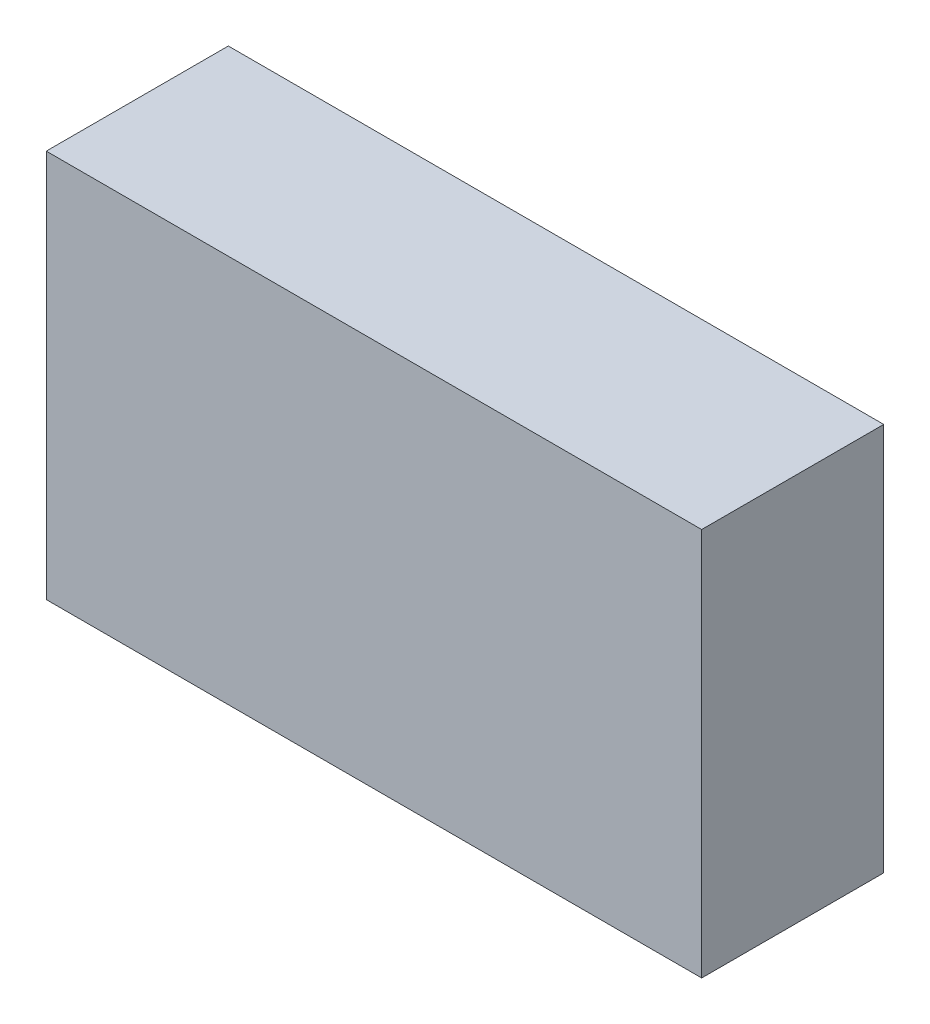
ISO-10303-21;
HEADER;
FILE_DESCRIPTION(('STEP AP214'),'2;1');
FILE_NAME('part.step','',(''),(''),'','','');
FILE_SCHEMA(('AUTOMOTIVE_DESIGN { 1 0 10303 214 1 1 1 1 }'));
ENDSEC;
DATA;
#1=APPLICATION_CONTEXT('core data for automotive mechanical design processes');
#2=APPLICATION_PROTOCOL_DEFINITION('international standard','automotive_design',2000,#1);
#3=PRODUCT_CONTEXT('',#1,'mechanical');
#4=PRODUCT('Part','Part','',(#3));
#5=PRODUCT_RELATED_PRODUCT_CATEGORY('part','',(#4));
#6=PRODUCT_DEFINITION_FORMATION('','',#4);
#7=PRODUCT_DEFINITION_CONTEXT('part definition',#1,'design');
#8=PRODUCT_DEFINITION('design','',#6,#7);
#9=PRODUCT_DEFINITION_SHAPE('','',#8);
#10=(LENGTH_UNIT() NAMED_UNIT(*) SI_UNIT(.MILLI.,.METRE.));
#11=(NAMED_UNIT(*) PLANE_ANGLE_UNIT() SI_UNIT($,.RADIAN.));
#12=(NAMED_UNIT(*) SI_UNIT($,.STERADIAN.) SOLID_ANGLE_UNIT());
#13=UNCERTAINTY_MEASURE_WITH_UNIT(LENGTH_MEASURE(1.E-05),#10,'distance_accuracy_value','');
#14=(GEOMETRIC_REPRESENTATION_CONTEXT(3) GLOBAL_UNCERTAINTY_ASSIGNED_CONTEXT((#13)) GLOBAL_UNIT_ASSIGNED_CONTEXT((#10,
#11,#12)) REPRESENTATION_CONTEXT('',''));
#15=CARTESIAN_POINT('',(0.,0.,0.));
#16=DIRECTION('',(0.,0.,1.));
#17=DIRECTION('',(1.,0.,0.));
#18=AXIS2_PLACEMENT_3D('',#15,#16,#17);
#19=CARTESIAN_POINT('',(28.575,16.9333333333333,-7.9475));
#20=DIRECTION('',(0.,1.,0.));
#21=DIRECTION('',(-1.,0.,0.));
#22=AXIS2_PLACEMENT_3D('',#19,#20,#21);
#23=PLANE('',#22);
#24=DIRECTION('',(-1.,0.,0.));
#25=VECTOR('',#24,1.);
#26=CARTESIAN_POINT('',(0.,16.9333333333333,-1.5875));
#27=LINE('',#26,#25);
#28=CARTESIAN_POINT('',(-19.05,16.9333333333333,-1.5875));
#29=VERTEX_POINT('',#28);
#30=CARTESIAN_POINT('',(-25.4,16.9333333333333,-1.5875));
#31=VERTEX_POINT('',#30);
#32=EDGE_CURVE('E251',#29,#31,#27,.T.);
#33=ORIENTED_EDGE('',*,*,#32,.T.);
#34=DIRECTION('',(0.,0.,-1.));
#35=VECTOR('',#34,1.);
#36=CARTESIAN_POINT('',(-25.4,16.9333333333333,0.));
#37=LINE('',#36,#35);
#38=CARTESIAN_POINT('',(-25.4,16.9333333333333,1.5875));
#39=VERTEX_POINT('',#38);
#40=EDGE_CURVE('E240',#39,#31,#37,.T.);
#41=ORIENTED_EDGE('',*,*,#40,.F.);
#42=DIRECTION('',(-1.,0.,0.));
#43=VECTOR('',#42,1.);
#44=CARTESIAN_POINT('',(0.,16.9333333333333,1.5875));
#45=LINE('',#44,#43);
#46=CARTESIAN_POINT('',(-19.05,16.9333333333333,1.5875));
#47=VERTEX_POINT('',#46);
#48=EDGE_CURVE('E158',#47,#39,#45,.T.);
#49=ORIENTED_EDGE('',*,*,#48,.F.);
#50=DIRECTION('',(0.,0.,-1.));
#51=VECTOR('',#50,1.);
#52=CARTESIAN_POINT('',(-19.05,16.9333333333333,0.));
#53=LINE('',#52,#51);
#54=CARTESIAN_POINT('',(-19.05,16.9333333333333,4.7625));
#55=VERTEX_POINT('',#54);
#56=EDGE_CURVE('E234',#55,#47,#53,.T.);
#57=ORIENTED_EDGE('',*,*,#56,.F.);
#58=DIRECTION('',(-1.,0.,0.));
#59=VECTOR('',#58,1.);
#60=CARTESIAN_POINT('',(0.,16.9333333333333,4.7625));
#61=LINE('',#60,#59);
#62=CARTESIAN_POINT('',(19.05,16.9333333333333,4.7625));
#63=VERTEX_POINT('',#62);
#64=EDGE_CURVE('E166',#63,#55,#61,.T.);
#65=ORIENTED_EDGE('',*,*,#64,.F.);
#66=DIRECTION('',(0.,0.,-1.));
#67=VECTOR('',#66,1.);
#68=CARTESIAN_POINT('',(19.05,16.9333333333333,0.));
#69=LINE('',#68,#67);
#70=CARTESIAN_POINT('',(19.05,16.9333333333333,1.5875));
#71=VERTEX_POINT('',#70);
#72=EDGE_CURVE('E162',#63,#71,#69,.T.);
#73=ORIENTED_EDGE('',*,*,#72,.T.);
#74=CARTESIAN_POINT('',(25.4,16.9333333333333,1.5875));
#75=VERTEX_POINT('',#74);
#76=EDGE_CURVE('E151',#75,#71,#45,.T.);
#77=ORIENTED_EDGE('',*,*,#76,.F.);
#78=DIRECTION('',(0.,0.,-1.));
#79=VECTOR('',#78,1.);
#80=CARTESIAN_POINT('',(25.4,16.9333333333333,0.));
#81=LINE('',#80,#79);
#82=CARTESIAN_POINT('',(25.4,16.9333333333333,-1.5875));
#83=VERTEX_POINT('',#82);
#84=EDGE_CURVE('E169',#75,#83,#81,.T.);
#85=ORIENTED_EDGE('',*,*,#84,.T.);
#86=CARTESIAN_POINT('',(19.05,16.9333333333333,-1.5875));
#87=VERTEX_POINT('',#86);
#88=EDGE_CURVE('E250',#83,#87,#27,.T.);
#89=ORIENTED_EDGE('',*,*,#88,.T.);
#90=DIRECTION('',(0.,0.,-1.));
#91=VECTOR('',#90,1.);
#92=CARTESIAN_POINT('',(19.05,16.9333333333333,0.));
#93=LINE('',#92,#91);
#94=CARTESIAN_POINT('',(19.05,16.9333333333333,-4.7625));
#95=VERTEX_POINT('',#94);
#96=EDGE_CURVE('E256',#87,#95,#93,.T.);
#97=ORIENTED_EDGE('',*,*,#96,.T.);
#98=DIRECTION('',(-1.,0.,0.));
#99=VECTOR('',#98,1.);
#100=CARTESIAN_POINT('',(0.,16.9333333333333,-4.7625));
#101=LINE('',#100,#99);
#102=CARTESIAN_POINT('',(-19.05,16.9333333333333,-4.7625));
#103=VERTEX_POINT('',#102);
#104=EDGE_CURVE('E253',#95,#103,#101,.T.);
#105=ORIENTED_EDGE('',*,*,#104,.T.);
#106=DIRECTION('',(0.,0.,-1.));
#107=VECTOR('',#106,1.);
#108=CARTESIAN_POINT('',(-19.05,16.9333333333333,0.));
#109=LINE('',#108,#107);
#110=EDGE_CURVE('E238',#29,#103,#109,.T.);
#111=ORIENTED_EDGE('',*,*,#110,.F.);
#112=EDGE_LOOP('',(#33,#41,#49,#57,#65,#73,#77,#85,#89,#97,#105,#111));
#113=FACE_BOUND('',#112,.T.);
#114=DIRECTION('',(0.,0.,-1.));
#115=VECTOR('',#114,1.);
#116=CARTESIAN_POINT('',(28.575,16.9333333333333,-7.9375));
#117=LINE('',#116,#115);
#118=CARTESIAN_POINT('',(28.575,16.9333333333333,7.9375));
#119=VERTEX_POINT('',#118);
#120=CARTESIAN_POINT('',(28.575,16.9333333333333,-7.9375));
#121=VERTEX_POINT('',#120);
#122=EDGE_CURVE('E247',#119,#121,#117,.T.);
#123=ORIENTED_EDGE('',*,*,#122,.F.);
#124=DIRECTION('',(1.,0.,0.));
#125=VECTOR('',#124,1.);
#126=CARTESIAN_POINT('',(-28.575,16.9333333333333,7.9375));
#127=LINE('',#126,#125);
#128=CARTESIAN_POINT('',(-28.575,16.9333333333333,7.9375));
#129=VERTEX_POINT('',#128);
#130=EDGE_CURVE('E159',#129,#119,#127,.T.);
#131=ORIENTED_EDGE('',*,*,#130,.F.);
#132=DIRECTION('',(0.,0.,1.));
#133=VECTOR('',#132,1.);
#134=CARTESIAN_POINT('',(-28.575,16.9333333333333,-7.9375));
#135=LINE('',#134,#133);
#136=CARTESIAN_POINT('',(-28.575,16.9333333333333,-7.9375));
#137=VERTEX_POINT('',#136);
#138=EDGE_CURVE('E243',#137,#129,#135,.T.);
#139=ORIENTED_EDGE('',*,*,#138,.F.);
#140=DIRECTION('',(-1.,0.,0.));
#141=VECTOR('',#140,1.);
#142=CARTESIAN_POINT('',(-28.575,16.9333333333333,-7.9375));
#143=LINE('',#142,#141);
#144=EDGE_CURVE('E245',#121,#137,#143,.T.);
#145=ORIENTED_EDGE('',*,*,#144,.F.);
#146=EDGE_LOOP('',(#123,#131,#139,#145));
#147=FACE_BOUND('',#146,.T.);
#148=ADVANCED_FACE('F32',(#113,#147),#23,.F.);
#149=CARTESIAN_POINT('',(0.,-102.485255392617,1.5875));
#150=DIRECTION('',(0.,0.,1.));
#151=DIRECTION('',(1.,0.,0.));
#152=AXIS2_PLACEMENT_3D('',#149,#150,#151);
#153=PLANE('',#152);
#154=DIRECTION('',(0.,1.,0.));
#155=VECTOR('',#154,1.);
#156=CARTESIAN_POINT('',(25.4,-102.485255392617,1.5875));
#157=LINE('',#156,#155);
#158=CARTESIAN_POINT('',(25.4,47.625,1.5875));
#159=VERTEX_POINT('',#158);
#160=EDGE_CURVE('E155',#75,#159,#157,.T.);
#161=ORIENTED_EDGE('',*,*,#160,.F.);
#162=ORIENTED_EDGE('',*,*,#76,.T.);
#163=DIRECTION('',(0.,1.,0.));
#164=VECTOR('',#163,1.);
#165=CARTESIAN_POINT('',(19.05,-102.485255392617,1.5875));
#166=LINE('',#165,#164);
#167=CARTESIAN_POINT('',(19.05,41.275,1.5875));
#168=VERTEX_POINT('',#167);
#169=EDGE_CURVE('E73',#71,#168,#166,.T.);
#170=ORIENTED_EDGE('',*,*,#169,.T.);
#171=DIRECTION('',(1.,0.,0.));
#172=VECTOR('',#171,1.);
#173=CARTESIAN_POINT('',(0.,41.275,1.5875));
#174=LINE('',#173,#172);
#175=CARTESIAN_POINT('',(-19.05,41.275,1.5875));
#176=VERTEX_POINT('',#175);
#177=EDGE_CURVE('E230',#176,#168,#174,.T.);
#178=ORIENTED_EDGE('',*,*,#177,.F.);
#179=DIRECTION('',(0.,1.,0.));
#180=VECTOR('',#179,1.);
#181=CARTESIAN_POINT('',(-19.05,-102.485255392617,1.5875));
#182=LINE('',#181,#180);
#183=EDGE_CURVE('E212',#47,#176,#182,.T.);
#184=ORIENTED_EDGE('',*,*,#183,.F.);
#185=ORIENTED_EDGE('',*,*,#48,.T.);
#186=DIRECTION('',(0.,1.,0.));
#187=VECTOR('',#186,1.);
#188=CARTESIAN_POINT('',(-25.4,-102.485255392617,1.5875));
#189=LINE('',#188,#187);
#190=CARTESIAN_POINT('',(-25.4,47.625,1.5875));
#191=VERTEX_POINT('',#190);
#192=EDGE_CURVE('E36',#39,#191,#189,.T.);
#193=ORIENTED_EDGE('',*,*,#192,.T.);
#194=DIRECTION('',(1.,0.,0.));
#195=VECTOR('',#194,1.);
#196=CARTESIAN_POINT('',(0.,47.625,1.5875));
#197=LINE('',#196,#195);
#198=EDGE_CURVE('E210',#191,#159,#197,.T.);
#199=ORIENTED_EDGE('',*,*,#198,.T.);
#200=EDGE_LOOP('',(#161,#162,#170,#178,#184,#185,#193,#199));
#201=FACE_BOUND('',#200,.T.);
#202=ADVANCED_FACE('F153',(#201),#153,.F.);
#203=CARTESIAN_POINT('',(-25.4,-102.485255392617,0.));
#204=DIRECTION('',(-1.,0.,0.));
#205=DIRECTION('',(0.,0.,1.));
#206=AXIS2_PLACEMENT_3D('',#203,#204,#205);
#207=PLANE('',#206);
#208=ORIENTED_EDGE('',*,*,#192,.F.);
#209=ORIENTED_EDGE('',*,*,#40,.T.);
#210=DIRECTION('',(0.,1.,0.));
#211=VECTOR('',#210,1.);
#212=CARTESIAN_POINT('',(-25.4,-102.485255392617,-1.5875));
#213=LINE('',#212,#211);
#214=CARTESIAN_POINT('',(-25.4,47.625,-1.5875));
#215=VERTEX_POINT('',#214);
#216=EDGE_CURVE('E189',#31,#215,#213,.T.);
#217=ORIENTED_EDGE('',*,*,#216,.T.);
#218=DIRECTION('',(0.,0.,1.));
#219=VECTOR('',#218,1.);
#220=CARTESIAN_POINT('',(-25.4,47.625,0.));
#221=LINE('',#220,#219);
#222=EDGE_CURVE('E207',#215,#191,#221,.T.);
#223=ORIENTED_EDGE('',*,*,#222,.T.);
#224=EDGE_LOOP('',(#208,#209,#217,#223));
#225=FACE_BOUND('',#224,.T.);
#226=ADVANCED_FACE('F286',(#225),#207,.F.);
#227=CARTESIAN_POINT('',(0.,-102.485255392617,-1.5875));
#228=DIRECTION('',(0.,0.,1.));
#229=DIRECTION('',(1.,0.,0.));
#230=AXIS2_PLACEMENT_3D('',#227,#228,#229);
#231=PLANE('',#230);
#232=ORIENTED_EDGE('',*,*,#88,.F.);
#233=DIRECTION('',(0.,1.,0.));
#234=VECTOR('',#233,1.);
#235=CARTESIAN_POINT('',(25.4,-102.485255392617,-1.5875));
#236=LINE('',#235,#234);
#237=CARTESIAN_POINT('',(25.4,47.625,-1.5875));
#238=VERTEX_POINT('',#237);
#239=EDGE_CURVE('E179',#83,#238,#236,.T.);
#240=ORIENTED_EDGE('',*,*,#239,.T.);
#241=DIRECTION('',(1.,0.,0.));
#242=VECTOR('',#241,1.);
#243=CARTESIAN_POINT('',(0.,47.625,-1.5875));
#244=LINE('',#243,#242);
#245=EDGE_CURVE('E209',#215,#238,#244,.T.);
#246=ORIENTED_EDGE('',*,*,#245,.F.);
#247=ORIENTED_EDGE('',*,*,#216,.F.);
#248=ORIENTED_EDGE('',*,*,#32,.F.);
#249=DIRECTION('',(0.,1.,0.));
#250=VECTOR('',#249,1.);
#251=CARTESIAN_POINT('',(-19.05,-102.485255392617,-1.5875));
#252=LINE('',#251,#250);
#253=CARTESIAN_POINT('',(-19.05,41.275,-1.5875));
#254=VERTEX_POINT('',#253);
#255=EDGE_CURVE('E188',#29,#254,#252,.T.);
#256=ORIENTED_EDGE('',*,*,#255,.T.);
#257=DIRECTION('',(1.,0.,0.));
#258=VECTOR('',#257,1.);
#259=CARTESIAN_POINT('',(0.,41.275,-1.5875));
#260=LINE('',#259,#258);
#261=CARTESIAN_POINT('',(19.05,41.275,-1.5875));
#262=VERTEX_POINT('',#261);
#263=EDGE_CURVE('E219',#254,#262,#260,.T.);
#264=ORIENTED_EDGE('',*,*,#263,.T.);
#265=DIRECTION('',(0.,1.,0.));
#266=VECTOR('',#265,1.);
#267=CARTESIAN_POINT('',(19.05,-102.485255392617,-1.5875));
#268=LINE('',#267,#266);
#269=EDGE_CURVE('E80',#87,#262,#268,.T.);
#270=ORIENTED_EDGE('',*,*,#269,.F.);
#271=EDGE_LOOP('',(#232,#240,#246,#247,#248,#256,#264,#270));
#272=FACE_BOUND('',#271,.T.);
#273=ADVANCED_FACE('F292',(#272),#231,.T.);
#274=CARTESIAN_POINT('',(-19.05,-102.485255392617,0.));
#275=DIRECTION('',(-1.,0.,0.));
#276=DIRECTION('',(0.,0.,1.));
#277=AXIS2_PLACEMENT_3D('',#274,#275,#276);
#278=PLANE('',#277);
#279=ORIENTED_EDGE('',*,*,#255,.F.);
#280=ORIENTED_EDGE('',*,*,#110,.T.);
#281=DIRECTION('',(0.,1.,0.));
#282=VECTOR('',#281,1.);
#283=CARTESIAN_POINT('',(-19.05,-102.485255392617,-4.7625));
#284=LINE('',#283,#282);
#285=CARTESIAN_POINT('',(-19.05,41.275,-4.7625));
#286=VERTEX_POINT('',#285);
#287=EDGE_CURVE('E186',#103,#286,#284,.T.);
#288=ORIENTED_EDGE('',*,*,#287,.T.);
#289=DIRECTION('',(0.,0.,1.));
#290=VECTOR('',#289,1.);
#291=CARTESIAN_POINT('',(-19.05,41.275,0.));
#292=LINE('',#291,#290);
#293=EDGE_CURVE('E221',#286,#254,#292,.T.);
#294=ORIENTED_EDGE('',*,*,#293,.T.);
#295=EDGE_LOOP('',(#279,#280,#288,#294));
#296=FACE_BOUND('',#295,.T.);
#297=ADVANCED_FACE('F303',(#296),#278,.F.);
#298=CARTESIAN_POINT('',(0.,-102.485255392617,-4.7625));
#299=DIRECTION('',(0.,0.,1.));
#300=DIRECTION('',(1.,0.,0.));
#301=AXIS2_PLACEMENT_3D('',#298,#299,#300);
#302=PLANE('',#301);
#303=ORIENTED_EDGE('',*,*,#104,.F.);
#304=DIRECTION('',(0.,1.,0.));
#305=VECTOR('',#304,1.);
#306=CARTESIAN_POINT('',(19.05,-102.485255392617,-4.7625));
#307=LINE('',#306,#305);
#308=CARTESIAN_POINT('',(19.05,41.275,-4.7625));
#309=VERTEX_POINT('',#308);
#310=EDGE_CURVE('E51',#95,#309,#307,.T.);
#311=ORIENTED_EDGE('',*,*,#310,.T.);
#312=DIRECTION('',(1.,0.,0.));
#313=VECTOR('',#312,1.);
#314=CARTESIAN_POINT('',(0.,41.275,-4.7625));
#315=LINE('',#314,#313);
#316=EDGE_CURVE('E42',#286,#309,#315,.T.);
#317=ORIENTED_EDGE('',*,*,#316,.F.);
#318=ORIENTED_EDGE('',*,*,#287,.F.);
#319=EDGE_LOOP('',(#303,#311,#317,#318));
#320=FACE_BOUND('',#319,.T.);
#321=ADVANCED_FACE('F305',(#320),#302,.T.);
#322=CARTESIAN_POINT('',(19.05,-102.485255392617,0.));
#323=DIRECTION('',(-1.,0.,0.));
#324=DIRECTION('',(0.,0.,1.));
#325=AXIS2_PLACEMENT_3D('',#322,#323,#324);
#326=PLANE('',#325);
#327=ORIENTED_EDGE('',*,*,#96,.F.);
#328=ORIENTED_EDGE('',*,*,#269,.T.);
#329=DIRECTION('',(0.,0.,1.));
#330=VECTOR('',#329,1.);
#331=CARTESIAN_POINT('',(19.05,41.275,0.));
#332=LINE('',#331,#330);
#333=EDGE_CURVE('E11',#309,#262,#332,.T.);
#334=ORIENTED_EDGE('',*,*,#333,.F.);
#335=ORIENTED_EDGE('',*,*,#310,.F.);
#336=EDGE_LOOP('',(#327,#328,#334,#335));
#337=FACE_BOUND('',#336,.T.);
#338=ADVANCED_FACE('F306',(#337),#326,.T.);
#339=CARTESIAN_POINT('',(25.4,-102.485255392617,0.));
#340=DIRECTION('',(-1.,0.,0.));
#341=DIRECTION('',(0.,0.,1.));
#342=AXIS2_PLACEMENT_3D('',#339,#340,#341);
#343=PLANE('',#342);
#344=ORIENTED_EDGE('',*,*,#84,.F.);
#345=ORIENTED_EDGE('',*,*,#160,.T.);
#346=DIRECTION('',(0.,0.,1.));
#347=VECTOR('',#346,1.);
#348=CARTESIAN_POINT('',(25.4,47.625,0.));
#349=LINE('',#348,#347);
#350=EDGE_CURVE('E213',#238,#159,#349,.T.);
#351=ORIENTED_EDGE('',*,*,#350,.F.);
#352=ORIENTED_EDGE('',*,*,#239,.F.);
#353=EDGE_LOOP('',(#344,#345,#351,#352));
#354=FACE_BOUND('',#353,.T.);
#355=ADVANCED_FACE('F296',(#354),#343,.T.);
#356=CARTESIAN_POINT('',(19.05,-102.485255392617,0.));
#357=DIRECTION('',(-1.,0.,0.));
#358=DIRECTION('',(0.,0.,1.));
#359=AXIS2_PLACEMENT_3D('',#356,#357,#358);
#360=PLANE('',#359);
#361=ORIENTED_EDGE('',*,*,#72,.F.);
#362=DIRECTION('',(0.,1.,0.));
#363=VECTOR('',#362,1.);
#364=CARTESIAN_POINT('',(19.05,-102.485255392617,4.7625));
#365=LINE('',#364,#363);
#366=CARTESIAN_POINT('',(19.05,41.275,4.7625));
#367=VERTEX_POINT('',#366);
#368=EDGE_CURVE('E175',#63,#367,#365,.T.);
#369=ORIENTED_EDGE('',*,*,#368,.T.);
#370=DIRECTION('',(0.,0.,1.));
#371=VECTOR('',#370,1.);
#372=CARTESIAN_POINT('',(19.05,41.275,0.));
#373=LINE('',#372,#371);
#374=EDGE_CURVE('E174',#168,#367,#373,.T.);
#375=ORIENTED_EDGE('',*,*,#374,.F.);
#376=ORIENTED_EDGE('',*,*,#169,.F.);
#377=EDGE_LOOP('',(#361,#369,#375,#376));
#378=FACE_BOUND('',#377,.T.);
#379=ADVANCED_FACE('F172',(#378),#360,.T.);
#380=CARTESIAN_POINT('',(0.,-102.485255392617,4.7625));
#381=DIRECTION('',(0.,0.,1.));
#382=DIRECTION('',(1.,0.,0.));
#383=AXIS2_PLACEMENT_3D('',#380,#381,#382);
#384=PLANE('',#383);
#385=ORIENTED_EDGE('',*,*,#368,.F.);
#386=ORIENTED_EDGE('',*,*,#64,.T.);
#387=DIRECTION('',(0.,1.,0.));
#388=VECTOR('',#387,1.);
#389=CARTESIAN_POINT('',(-19.05,-102.485255392617,4.7625));
#390=LINE('',#389,#388);
#391=CARTESIAN_POINT('',(-19.05,41.275,4.7625));
#392=VERTEX_POINT('',#391);
#393=EDGE_CURVE('E177',#55,#392,#390,.T.);
#394=ORIENTED_EDGE('',*,*,#393,.T.);
#395=DIRECTION('',(1.,0.,0.));
#396=VECTOR('',#395,1.);
#397=CARTESIAN_POINT('',(0.,41.275,4.7625));
#398=LINE('',#397,#396);
#399=EDGE_CURVE('E216',#392,#367,#398,.T.);
#400=ORIENTED_EDGE('',*,*,#399,.T.);
#401=EDGE_LOOP('',(#385,#386,#394,#400));
#402=FACE_BOUND('',#401,.T.);
#403=ADVANCED_FACE('F276',(#402),#384,.F.);
#404=CARTESIAN_POINT('',(-19.05,-102.485255392617,0.));
#405=DIRECTION('',(-1.,0.,0.));
#406=DIRECTION('',(0.,0.,1.));
#407=AXIS2_PLACEMENT_3D('',#404,#405,#406);
#408=PLANE('',#407);
#409=ORIENTED_EDGE('',*,*,#393,.F.);
#410=ORIENTED_EDGE('',*,*,#56,.T.);
#411=ORIENTED_EDGE('',*,*,#183,.T.);
#412=DIRECTION('',(0.,0.,1.));
#413=VECTOR('',#412,1.);
#414=CARTESIAN_POINT('',(-19.05,41.275,0.));
#415=LINE('',#414,#413);
#416=EDGE_CURVE('E228',#176,#392,#415,.T.);
#417=ORIENTED_EDGE('',*,*,#416,.T.);
#418=EDGE_LOOP('',(#409,#410,#411,#417));
#419=FACE_BOUND('',#418,.T.);
#420=ADVANCED_FACE('F281',(#419),#408,.F.);
#421=CARTESIAN_POINT('',(0.,47.625,0.));
#422=DIRECTION('',(0.,1.,0.));
#423=DIRECTION('',(0.,0.,1.));
#424=AXIS2_PLACEMENT_3D('',#421,#422,#423);
#425=PLANE('',#424);
#426=ORIENTED_EDGE('',*,*,#222,.F.);
#427=ORIENTED_EDGE('',*,*,#245,.T.);
#428=ORIENTED_EDGE('',*,*,#350,.T.);
#429=ORIENTED_EDGE('',*,*,#198,.F.);
#430=EDGE_LOOP('',(#426,#427,#428,#429));
#431=FACE_BOUND('',#430,.T.);
#432=ADVANCED_FACE('F289',(#431),#425,.F.);
#433=CARTESIAN_POINT('',(0.,41.275,0.));
#434=DIRECTION('',(0.,1.,0.));
#435=DIRECTION('',(0.,0.,1.));
#436=AXIS2_PLACEMENT_3D('',#433,#434,#435);
#437=PLANE('',#436);
#438=ORIENTED_EDGE('',*,*,#374,.T.);
#439=ORIENTED_EDGE('',*,*,#399,.F.);
#440=ORIENTED_EDGE('',*,*,#416,.F.);
#441=ORIENTED_EDGE('',*,*,#177,.T.);
#442=EDGE_LOOP('',(#438,#439,#440,#441));
#443=FACE_BOUND('',#442,.T.);
#444=ADVANCED_FACE('F280',(#443),#437,.F.);
#445=CARTESIAN_POINT('',(0.,41.275,0.));
#446=DIRECTION('',(0.,1.,0.));
#447=DIRECTION('',(0.,0.,1.));
#448=AXIS2_PLACEMENT_3D('',#445,#446,#447);
#449=PLANE('',#448);
#450=ORIENTED_EDGE('',*,*,#333,.T.);
#451=ORIENTED_EDGE('',*,*,#263,.F.);
#452=ORIENTED_EDGE('',*,*,#293,.F.);
#453=ORIENTED_EDGE('',*,*,#316,.T.);
#454=EDGE_LOOP('',(#450,#451,#452,#453));
#455=FACE_BOUND('',#454,.T.);
#456=ADVANCED_FACE('F301',(#455),#449,.F.);
#457=CARTESIAN_POINT('',(28.575,50.8,-7.9375));
#458=DIRECTION('',(-1.,0.,0.));
#459=DIRECTION('',(0.,0.,1.));
#460=AXIS2_PLACEMENT_3D('',#457,#458,#459);
#461=PLANE('',#460);
#462=DIRECTION('',(0.,-1.,0.));
#463=VECTOR('',#462,1.);
#464=CARTESIAN_POINT('',(28.575,50.8,7.9375));
#465=LINE('',#464,#463);
#466=CARTESIAN_POINT('',(28.575,50.8,7.9375));
#467=VERTEX_POINT('',#466);
#468=EDGE_CURVE('E268',#467,#119,#465,.T.);
#469=ORIENTED_EDGE('',*,*,#468,.T.);
#470=ORIENTED_EDGE('',*,*,#122,.T.);
#471=DIRECTION('',(0.,-1.,0.));
#472=VECTOR('',#471,1.);
#473=CARTESIAN_POINT('',(28.575,50.8,-7.9375));
#474=LINE('',#473,#472);
#475=CARTESIAN_POINT('',(28.575,50.8,-7.9375));
#476=VERTEX_POINT('',#475);
#477=EDGE_CURVE('E236',#476,#121,#474,.T.);
#478=ORIENTED_EDGE('',*,*,#477,.F.);
#479=DIRECTION('',(0.,0.,-1.));
#480=VECTOR('',#479,1.);
#481=CARTESIAN_POINT('',(28.575,50.8,-7.9375));
#482=LINE('',#481,#480);
#483=EDGE_CURVE('E194',#467,#476,#482,.T.);
#484=ORIENTED_EDGE('',*,*,#483,.F.);
#485=EDGE_LOOP('',(#469,#470,#478,#484));
#486=FACE_BOUND('',#485,.T.);
#487=ADVANCED_FACE('F336',(#486),#461,.F.);
#488=CARTESIAN_POINT('',(-28.575,50.8,-7.9375));
#489=DIRECTION('',(0.,0.,1.));
#490=DIRECTION('',(1.,0.,0.));
#491=AXIS2_PLACEMENT_3D('',#488,#489,#490);
#492=PLANE('',#491);
#493=ORIENTED_EDGE('',*,*,#477,.T.);
#494=ORIENTED_EDGE('',*,*,#144,.T.);
#495=DIRECTION('',(0.,-1.,0.));
#496=VECTOR('',#495,1.);
#497=CARTESIAN_POINT('',(-28.575,50.8,-7.9375));
#498=LINE('',#497,#496);
#499=CARTESIAN_POINT('',(-28.575,50.8,-7.9375));
#500=VERTEX_POINT('',#499);
#501=EDGE_CURVE('E262',#500,#137,#498,.T.);
#502=ORIENTED_EDGE('',*,*,#501,.F.);
#503=DIRECTION('',(-1.,0.,0.));
#504=VECTOR('',#503,1.);
#505=CARTESIAN_POINT('',(-28.575,50.8,-7.9375));
#506=LINE('',#505,#504);
#507=EDGE_CURVE('E198',#476,#500,#506,.T.);
#508=ORIENTED_EDGE('',*,*,#507,.F.);
#509=EDGE_LOOP('',(#493,#494,#502,#508));
#510=FACE_BOUND('',#509,.T.);
#511=ADVANCED_FACE('F355',(#510),#492,.F.);
#512=CARTESIAN_POINT('',(-28.575,50.8,-7.9375));
#513=DIRECTION('',(1.,0.,0.));
#514=DIRECTION('',(0.,0.,-1.));
#515=AXIS2_PLACEMENT_3D('',#512,#513,#514);
#516=PLANE('',#515);
#517=ORIENTED_EDGE('',*,*,#501,.T.);
#518=ORIENTED_EDGE('',*,*,#138,.T.);
#519=DIRECTION('',(0.,-1.,0.));
#520=VECTOR('',#519,1.);
#521=CARTESIAN_POINT('',(-28.575,50.8,7.9375));
#522=LINE('',#521,#520);
#523=CARTESIAN_POINT('',(-28.575,50.8,7.9375));
#524=VERTEX_POINT('',#523);
#525=EDGE_CURVE('E265',#524,#129,#522,.T.);
#526=ORIENTED_EDGE('',*,*,#525,.F.);
#527=DIRECTION('',(0.,0.,1.));
#528=VECTOR('',#527,1.);
#529=CARTESIAN_POINT('',(-28.575,50.8,-7.9375));
#530=LINE('',#529,#528);
#531=EDGE_CURVE('E203',#500,#524,#530,.T.);
#532=ORIENTED_EDGE('',*,*,#531,.F.);
#533=EDGE_LOOP('',(#517,#518,#526,#532));
#534=FACE_BOUND('',#533,.T.);
#535=ADVANCED_FACE('F330',(#534),#516,.F.);
#536=CARTESIAN_POINT('',(-28.575,50.8,7.9375));
#537=DIRECTION('',(0.,0.,-1.));
#538=DIRECTION('',(-1.,0.,0.));
#539=AXIS2_PLACEMENT_3D('',#536,#537,#538);
#540=PLANE('',#539);
#541=ORIENTED_EDGE('',*,*,#525,.T.);
#542=ORIENTED_EDGE('',*,*,#130,.T.);
#543=ORIENTED_EDGE('',*,*,#468,.F.);
#544=DIRECTION('',(1.,0.,0.));
#545=VECTOR('',#544,1.);
#546=CARTESIAN_POINT('',(-28.575,50.8,7.9375));
#547=LINE('',#546,#545);
#548=EDGE_CURVE('E271',#524,#467,#547,.T.);
#549=ORIENTED_EDGE('',*,*,#548,.F.);
#550=EDGE_LOOP('',(#541,#542,#543,#549));
#551=FACE_BOUND('',#550,.T.);
#552=ADVANCED_FACE('F34',(#551),#540,.F.);
#553=CARTESIAN_POINT('',(0.,50.8,0.));
#554=DIRECTION('',(0.,1.,0.));
#555=DIRECTION('',(0.,0.,1.));
#556=AXIS2_PLACEMENT_3D('',#553,#554,#555);
#557=PLANE('',#556);
#558=ORIENTED_EDGE('',*,*,#483,.T.);
#559=ORIENTED_EDGE('',*,*,#507,.T.);
#560=ORIENTED_EDGE('',*,*,#531,.T.);
#561=ORIENTED_EDGE('',*,*,#548,.T.);
#562=EDGE_LOOP('',(#558,#559,#560,#561));
#563=FACE_BOUND('',#562,.T.);
#564=ADVANCED_FACE('F318',(#563),#557,.T.);
#565=CLOSED_SHELL('',(#148,#202,#226,#273,#297,#321,#338,#355,#379,#403,#420,#432,#444,#456,
#487,#511,#535,#552,#564));
#566=MANIFOLD_SOLID_BREP('B2',#565);
#567=ADVANCED_BREP_SHAPE_REPRESENTATION('',(#18,#566),#14);
#568=SHAPE_DEFINITION_REPRESENTATION(#9,#567);
ENDSEC;
END-ISO-10303-21;
